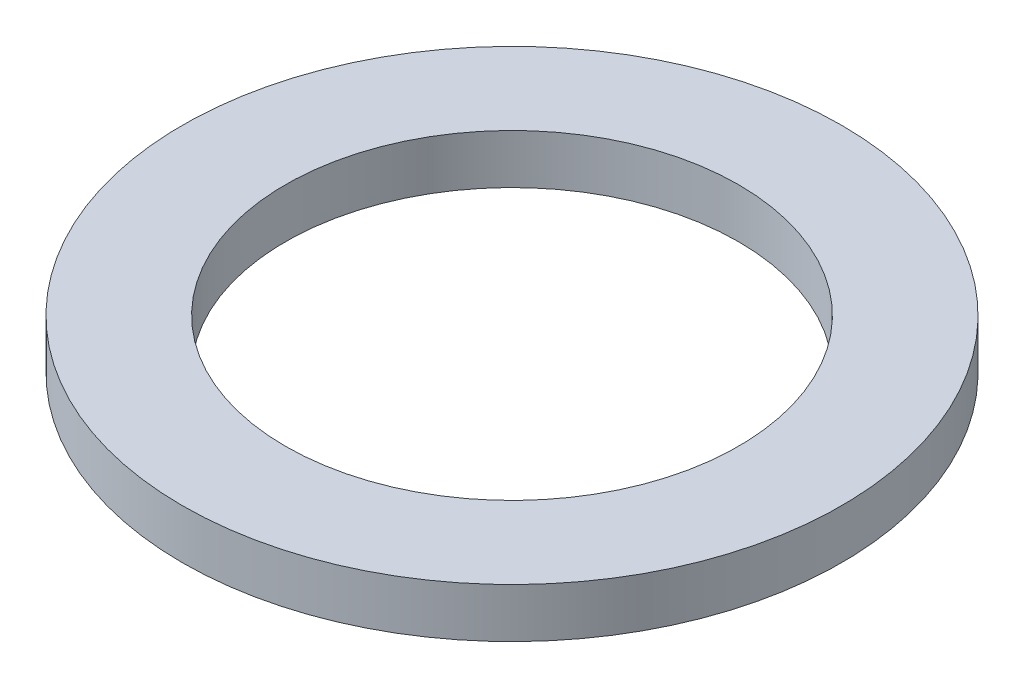
ISO-10303-21;
HEADER;
FILE_DESCRIPTION(('STEP AP214'),'2;1');
FILE_NAME('part.step','',(''),(''),'','','');
FILE_SCHEMA(('AUTOMOTIVE_DESIGN { 1 0 10303 214 1 1 1 1 }'));
ENDSEC;
DATA;
#1=APPLICATION_CONTEXT('core data for automotive mechanical design processes');
#2=APPLICATION_PROTOCOL_DEFINITION('international standard','automotive_design',2000,#1);
#3=PRODUCT_CONTEXT('',#1,'mechanical');
#4=PRODUCT('Part','Part','',(#3));
#5=PRODUCT_RELATED_PRODUCT_CATEGORY('part','',(#4));
#6=PRODUCT_DEFINITION_FORMATION('','',#4);
#7=PRODUCT_DEFINITION_CONTEXT('part definition',#1,'design');
#8=PRODUCT_DEFINITION('design','',#6,#7);
#9=PRODUCT_DEFINITION_SHAPE('','',#8);
#10=(LENGTH_UNIT() NAMED_UNIT(*) SI_UNIT(.MILLI.,.METRE.));
#11=(NAMED_UNIT(*) PLANE_ANGLE_UNIT() SI_UNIT($,.RADIAN.));
#12=(NAMED_UNIT(*) SI_UNIT($,.STERADIAN.) SOLID_ANGLE_UNIT());
#13=UNCERTAINTY_MEASURE_WITH_UNIT(LENGTH_MEASURE(1.E-05),#10,'distance_accuracy_value','');
#14=(GEOMETRIC_REPRESENTATION_CONTEXT(3) GLOBAL_UNCERTAINTY_ASSIGNED_CONTEXT((#13)) GLOBAL_UNIT_ASSIGNED_CONTEXT((#10,
#11,#12)) REPRESENTATION_CONTEXT('',''));
#15=CARTESIAN_POINT('',(0.,0.,0.));
#16=DIRECTION('',(0.,0.,1.));
#17=DIRECTION('',(1.,0.,0.));
#18=AXIS2_PLACEMENT_3D('',#15,#16,#17);
#19=CARTESIAN_POINT('',(0.,6.,0.));
#20=DIRECTION('',(0.,-1.,0.));
#21=DIRECTION('',(0.,0.,-1.));
#22=AXIS2_PLACEMENT_3D('',#19,#20,#21);
#23=CYLINDRICAL_SURFACE('',#22,40.);
#24=CARTESIAN_POINT('',(0.,6.,0.));
#25=DIRECTION('',(0.,1.,0.));
#26=DIRECTION('',(0.,0.,1.));
#27=AXIS2_PLACEMENT_3D('',#24,#25,#26);
#28=CIRCLE('',#27,40.);
#29=CARTESIAN_POINT('',(0.,6.,40.));
#30=VERTEX_POINT('',#29);
#31=EDGE_CURVE('E10',#30,#30,#28,.T.);
#32=ORIENTED_EDGE('',*,*,#31,.F.);
#33=EDGE_LOOP('',(#32));
#34=FACE_BOUND('',#33,.T.);
#35=CARTESIAN_POINT('',(0.,0.,0.));
#36=DIRECTION('',(0.,1.,0.));
#37=DIRECTION('',(0.,0.,1.));
#38=AXIS2_PLACEMENT_3D('',#35,#36,#37);
#39=CIRCLE('',#38,40.);
#40=CARTESIAN_POINT('',(0.,0.,40.));
#41=VERTEX_POINT('',#40);
#42=EDGE_CURVE('E37',#41,#41,#39,.T.);
#43=ORIENTED_EDGE('',*,*,#42,.T.);
#44=EDGE_LOOP('',(#43));
#45=FACE_BOUND('',#44,.T.);
#46=ADVANCED_FACE('F40',(#34,#45),#23,.T.);
#47=CARTESIAN_POINT('',(0.,6.,0.));
#48=DIRECTION('',(0.,1.,0.));
#49=DIRECTION('',(0.,0.,1.));
#50=AXIS2_PLACEMENT_3D('',#47,#48,#49);
#51=PLANE('',#50);
#52=CARTESIAN_POINT('',(0.,6.,0.));
#53=DIRECTION('',(0.,1.,0.));
#54=DIRECTION('',(0.,0.,1.));
#55=AXIS2_PLACEMENT_3D('',#52,#53,#54);
#56=CIRCLE('',#55,27.5);
#57=CARTESIAN_POINT('',(0.,6.,27.5));
#58=VERTEX_POINT('',#57);
#59=EDGE_CURVE('E50',#58,#58,#56,.T.);
#60=ORIENTED_EDGE('',*,*,#59,.F.);
#61=EDGE_LOOP('',(#60));
#62=FACE_BOUND('',#61,.T.);
#63=ORIENTED_EDGE('',*,*,#31,.T.);
#64=EDGE_LOOP('',(#63));
#65=FACE_BOUND('',#64,.T.);
#66=ADVANCED_FACE('F59',(#62,#65),#51,.T.);
#67=CARTESIAN_POINT('',(0.,0.,0.));
#68=DIRECTION('',(0.,1.,0.));
#69=DIRECTION('',(0.,0.,1.));
#70=AXIS2_PLACEMENT_3D('',#67,#68,#69);
#71=PLANE('',#70);
#72=CARTESIAN_POINT('',(0.,0.,0.));
#73=DIRECTION('',(0.,1.,0.));
#74=DIRECTION('',(0.,0.,1.));
#75=AXIS2_PLACEMENT_3D('',#72,#73,#74);
#76=CIRCLE('',#75,27.5);
#77=CARTESIAN_POINT('',(0.,0.,27.5));
#78=VERTEX_POINT('',#77);
#79=EDGE_CURVE('E47',#78,#78,#76,.T.);
#80=ORIENTED_EDGE('',*,*,#79,.T.);
#81=EDGE_LOOP('',(#80));
#82=FACE_BOUND('',#81,.T.);
#83=ORIENTED_EDGE('',*,*,#42,.F.);
#84=EDGE_LOOP('',(#83));
#85=FACE_BOUND('',#84,.T.);
#86=ADVANCED_FACE('F58',(#82,#85),#71,.F.);
#87=CARTESIAN_POINT('',(0.,6.,0.));
#88=DIRECTION('',(0.,-1.,0.));
#89=DIRECTION('',(0.,0.,-1.));
#90=AXIS2_PLACEMENT_3D('',#87,#88,#89);
#91=CYLINDRICAL_SURFACE('',#90,27.5);
#92=ORIENTED_EDGE('',*,*,#59,.T.);
#93=EDGE_LOOP('',(#92));
#94=FACE_BOUND('',#93,.T.);
#95=ORIENTED_EDGE('',*,*,#79,.F.);
#96=EDGE_LOOP('',(#95));
#97=FACE_BOUND('',#96,.T.);
#98=ADVANCED_FACE('F54',(#94,#97),#91,.F.);
#99=CLOSED_SHELL('',(#46,#66,#86,#98));
#100=MANIFOLD_SOLID_BREP('B2',#99);
#101=ADVANCED_BREP_SHAPE_REPRESENTATION('',(#18,#100),#14);
#102=SHAPE_DEFINITION_REPRESENTATION(#9,#101);
ENDSEC;
END-ISO-10303-21;
